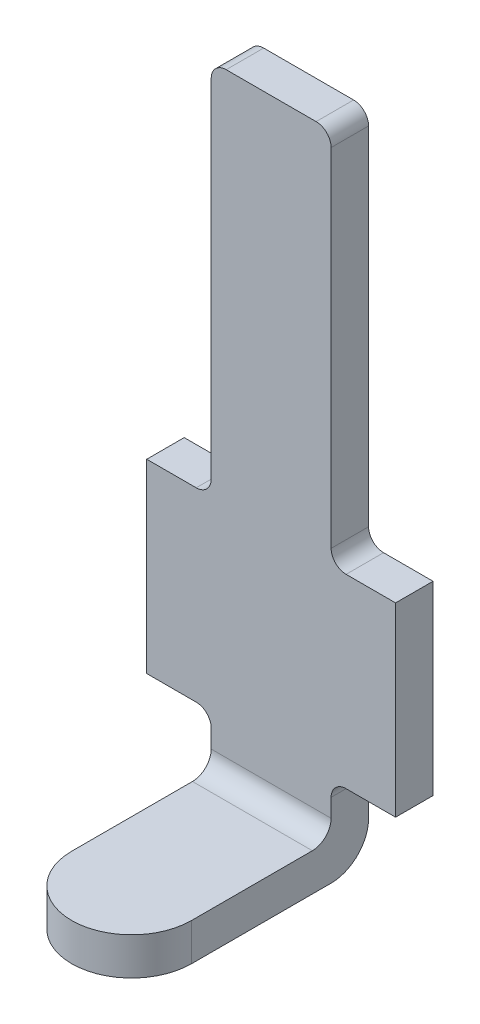
ISO-10303-21;
HEADER;
FILE_DESCRIPTION(('STEP AP214'),'2;1');
FILE_NAME('part.step','',(''),(''),'','','');
FILE_SCHEMA(('AUTOMOTIVE_DESIGN { 1 0 10303 214 1 1 1 1 }'));
ENDSEC;
DATA;
#1=APPLICATION_CONTEXT('core data for automotive mechanical design processes');
#2=APPLICATION_PROTOCOL_DEFINITION('international standard','automotive_design',2000,#1);
#3=PRODUCT_CONTEXT('',#1,'mechanical');
#4=PRODUCT('Part','Part','',(#3));
#5=PRODUCT_RELATED_PRODUCT_CATEGORY('part','',(#4));
#6=PRODUCT_DEFINITION_FORMATION('','',#4);
#7=PRODUCT_DEFINITION_CONTEXT('part definition',#1,'design');
#8=PRODUCT_DEFINITION('design','',#6,#7);
#9=PRODUCT_DEFINITION_SHAPE('','',#8);
#10=(LENGTH_UNIT() NAMED_UNIT(*) SI_UNIT(.MILLI.,.METRE.));
#11=(NAMED_UNIT(*) PLANE_ANGLE_UNIT() SI_UNIT($,.RADIAN.));
#12=(NAMED_UNIT(*) SI_UNIT($,.STERADIAN.) SOLID_ANGLE_UNIT());
#13=UNCERTAINTY_MEASURE_WITH_UNIT(LENGTH_MEASURE(1.E-05),#10,'distance_accuracy_value','');
#14=(GEOMETRIC_REPRESENTATION_CONTEXT(3) GLOBAL_UNCERTAINTY_ASSIGNED_CONTEXT((#13)) GLOBAL_UNIT_ASSIGNED_CONTEXT((#10,
#11,#12)) REPRESENTATION_CONTEXT('',''));
#15=CARTESIAN_POINT('',(0.,0.,0.));
#16=DIRECTION('',(0.,0.,1.));
#17=DIRECTION('',(1.,0.,0.));
#18=AXIS2_PLACEMENT_3D('',#15,#16,#17);
#19=CARTESIAN_POINT('',(8.39,0.0459658151929143,0.749000000000012));
#20=DIRECTION('',(0.,0.,-1.));
#21=DIRECTION('',(-1.,0.,0.));
#22=AXIS2_PLACEMENT_3D('',#19,#20,#21);
#23=CYLINDRICAL_SURFACE('',#22,0.1);
#24=CARTESIAN_POINT('',(8.39,0.0459658151929143,0.498999999999983));
#25=DIRECTION('',(0.,0.,1.));
#26=DIRECTION('',(1.,0.,0.));
#27=AXIS2_PLACEMENT_3D('',#24,#25,#26);
#28=CIRCLE('',#27,0.1);
#29=CARTESIAN_POINT('',(8.49,0.0459658151929143,0.498999999999983));
#30=VERTEX_POINT('',#29);
#31=CARTESIAN_POINT('',(8.39,0.145965815192914,0.499000000000012));
#32=VERTEX_POINT('',#31);
#33=EDGE_CURVE('E411',#30,#32,#28,.T.);
#34=ORIENTED_EDGE('',*,*,#33,.F.);
#35=DIRECTION('',(0.,0.,-1.));
#36=VECTOR('',#35,1.);
#37=CARTESIAN_POINT('',(8.49,0.0459658151929143,0.499000000000012));
#38=LINE('',#37,#36);
#39=CARTESIAN_POINT('',(8.49,0.0459658151929143,0.748999999999983));
#40=VERTEX_POINT('',#39);
#41=EDGE_CURVE('E20',#40,#30,#38,.T.);
#42=ORIENTED_EDGE('',*,*,#41,.F.);
#43=CARTESIAN_POINT('',(8.39,0.0459658151929143,0.748999999999983));
#44=DIRECTION('',(0.,0.,-1.));
#45=DIRECTION('',(-1.,0.,0.));
#46=AXIS2_PLACEMENT_3D('',#43,#44,#45);
#47=CIRCLE('',#46,0.1);
#48=CARTESIAN_POINT('',(8.39,0.145965815192914,0.749000000000012));
#49=VERTEX_POINT('',#48);
#50=EDGE_CURVE('E428',#49,#40,#47,.T.);
#51=ORIENTED_EDGE('',*,*,#50,.F.);
#52=DIRECTION('',(0.,0.,1.));
#53=VECTOR('',#52,1.);
#54=CARTESIAN_POINT('',(8.39,0.145965815192914,0.748999999999983));
#55=LINE('',#54,#53);
#56=EDGE_CURVE('E434',#32,#49,#55,.T.);
#57=ORIENTED_EDGE('',*,*,#56,.F.);
#58=EDGE_LOOP('',(#34,#42,#51,#57));
#59=FACE_BOUND('',#58,.T.);
#60=ADVANCED_FACE('F16',(#59),#23,.F.);
#61=CARTESIAN_POINT('',(9.39,0.0459658151929143,0.748999999999984));
#62=DIRECTION('',(0.,0.,1.));
#63=DIRECTION('',(1.,0.,0.));
#64=AXIS2_PLACEMENT_3D('',#61,#62,#63);
#65=CYLINDRICAL_SURFACE('',#64,0.1);
#66=CARTESIAN_POINT('',(9.39,0.0459658151929143,0.498999999999984));
#67=DIRECTION('',(0.,0.,1.));
#68=DIRECTION('',(1.,0.,0.));
#69=AXIS2_PLACEMENT_3D('',#66,#67,#68);
#70=CIRCLE('',#69,0.1);
#71=CARTESIAN_POINT('',(9.39,0.145965815192914,0.499000000000013));
#72=VERTEX_POINT('',#71);
#73=CARTESIAN_POINT('',(9.29,0.0459658151929143,0.498999999999984));
#74=VERTEX_POINT('',#73);
#75=EDGE_CURVE('E250',#72,#74,#70,.T.);
#76=ORIENTED_EDGE('',*,*,#75,.F.);
#77=DIRECTION('',(0.,0.,-1.));
#78=VECTOR('',#77,1.);
#79=CARTESIAN_POINT('',(9.39,0.145965815192914,0.749000000000013));
#80=LINE('',#79,#78);
#81=CARTESIAN_POINT('',(9.39,0.145965815192914,0.749000000000013));
#82=VERTEX_POINT('',#81);
#83=EDGE_CURVE('E27',#82,#72,#80,.T.);
#84=ORIENTED_EDGE('',*,*,#83,.F.);
#85=CARTESIAN_POINT('',(9.39,0.0459658151929143,0.748999999999984));
#86=DIRECTION('',(0.,0.,-1.));
#87=DIRECTION('',(-1.,0.,0.));
#88=AXIS2_PLACEMENT_3D('',#85,#86,#87);
#89=CIRCLE('',#88,0.1);
#90=CARTESIAN_POINT('',(9.29,0.0459658151929143,0.748999999999984));
#91=VERTEX_POINT('',#90);
#92=EDGE_CURVE('E438',#91,#82,#89,.T.);
#93=ORIENTED_EDGE('',*,*,#92,.F.);
#94=DIRECTION('',(0.,0.,1.));
#95=VECTOR('',#94,1.);
#96=CARTESIAN_POINT('',(9.29,0.0459658151929143,0.748999999999984));
#97=LINE('',#96,#95);
#98=EDGE_CURVE('E266',#74,#91,#97,.T.);
#99=ORIENTED_EDGE('',*,*,#98,.F.);
#100=EDGE_LOOP('',(#76,#84,#93,#99));
#101=FACE_BOUND('',#100,.T.);
#102=ADVANCED_FACE('F534',(#101),#65,.F.);
#103=CARTESIAN_POINT('',(8.39,1.48437551370885,0.748999999999983));
#104=DIRECTION('',(0.,0.,1.));
#105=DIRECTION('',(1.,0.,0.));
#106=AXIS2_PLACEMENT_3D('',#103,#104,#105);
#107=CYLINDRICAL_SURFACE('',#106,0.1);
#108=CARTESIAN_POINT('',(8.39,1.48437551370885,0.498999999999983));
#109=DIRECTION('',(0.,0.,1.));
#110=DIRECTION('',(1.,0.,0.));
#111=AXIS2_PLACEMENT_3D('',#108,#109,#110);
#112=CIRCLE('',#111,0.1);
#113=CARTESIAN_POINT('',(8.39,1.38437551370885,0.499000000000012));
#114=VERTEX_POINT('',#113);
#115=CARTESIAN_POINT('',(8.49,1.48437551370885,0.498999999999983));
#116=VERTEX_POINT('',#115);
#117=EDGE_CURVE('E321',#114,#116,#112,.T.);
#118=ORIENTED_EDGE('',*,*,#117,.F.);
#119=DIRECTION('',(0.,0.,-1.));
#120=VECTOR('',#119,1.);
#121=CARTESIAN_POINT('',(8.39,1.38437551370885,0.749000000000012));
#122=LINE('',#121,#120);
#123=CARTESIAN_POINT('',(8.39,1.38437551370885,0.749000000000012));
#124=VERTEX_POINT('',#123);
#125=EDGE_CURVE('E42',#124,#114,#122,.T.);
#126=ORIENTED_EDGE('',*,*,#125,.F.);
#127=CARTESIAN_POINT('',(8.39,1.48437551370885,0.748999999999983));
#128=DIRECTION('',(0.,0.,-1.));
#129=DIRECTION('',(-1.,0.,0.));
#130=AXIS2_PLACEMENT_3D('',#127,#128,#129);
#131=CIRCLE('',#130,0.1);
#132=CARTESIAN_POINT('',(8.49,1.48437551370885,0.748999999999983));
#133=VERTEX_POINT('',#132);
#134=EDGE_CURVE('E265',#133,#124,#131,.T.);
#135=ORIENTED_EDGE('',*,*,#134,.F.);
#136=DIRECTION('',(0.,0.,1.));
#137=VECTOR('',#136,1.);
#138=CARTESIAN_POINT('',(8.49,1.48437551370885,0.748999999999983));
#139=LINE('',#138,#137);
#140=EDGE_CURVE('E240',#116,#133,#139,.T.);
#141=ORIENTED_EDGE('',*,*,#140,.F.);
#142=EDGE_LOOP('',(#118,#126,#135,#141));
#143=FACE_BOUND('',#142,.T.);
#144=ADVANCED_FACE('F540',(#143),#107,.F.);
#145=CARTESIAN_POINT('',(9.39,1.48437551370885,0.749000000000014));
#146=DIRECTION('',(0.,0.,-1.));
#147=DIRECTION('',(-1.,0.,0.));
#148=AXIS2_PLACEMENT_3D('',#145,#146,#147);
#149=CYLINDRICAL_SURFACE('',#148,0.1);
#150=CARTESIAN_POINT('',(9.39,1.48437551370885,0.498999999999985));
#151=DIRECTION('',(0.,0.,1.));
#152=DIRECTION('',(1.,0.,0.));
#153=AXIS2_PLACEMENT_3D('',#150,#151,#152);
#154=CIRCLE('',#153,0.1);
#155=CARTESIAN_POINT('',(9.29,1.48437551370885,0.498999999999984));
#156=VERTEX_POINT('',#155);
#157=CARTESIAN_POINT('',(9.39,1.38437551370885,0.499000000000013));
#158=VERTEX_POINT('',#157);
#159=EDGE_CURVE('E216',#156,#158,#154,.T.);
#160=ORIENTED_EDGE('',*,*,#159,.F.);
#161=DIRECTION('',(0.,0.,-1.));
#162=VECTOR('',#161,1.);
#163=CARTESIAN_POINT('',(9.29,1.48437551370885,0.498999999999984));
#164=LINE('',#163,#162);
#165=CARTESIAN_POINT('',(9.29,1.48437551370885,0.748999999999984));
#166=VERTEX_POINT('',#165);
#167=EDGE_CURVE('E340',#166,#156,#164,.T.);
#168=ORIENTED_EDGE('',*,*,#167,.F.);
#169=CARTESIAN_POINT('',(9.39,1.48437551370885,0.748999999999984));
#170=DIRECTION('',(0.,0.,-1.));
#171=DIRECTION('',(-1.,0.,0.));
#172=AXIS2_PLACEMENT_3D('',#169,#170,#171);
#173=CIRCLE('',#172,0.1);
#174=CARTESIAN_POINT('',(9.39,1.38437551370885,0.749000000000014));
#175=VERTEX_POINT('',#174);
#176=EDGE_CURVE('E168',#175,#166,#173,.T.);
#177=ORIENTED_EDGE('',*,*,#176,.F.);
#178=DIRECTION('',(0.,0.,1.));
#179=VECTOR('',#178,1.);
#180=CARTESIAN_POINT('',(9.39,1.38437551370885,0.748999999999984));
#181=LINE('',#180,#179);
#182=EDGE_CURVE('E394',#158,#175,#181,.T.);
#183=ORIENTED_EDGE('',*,*,#182,.F.);
#184=EDGE_LOOP('',(#160,#168,#177,#183));
#185=FACE_BOUND('',#184,.T.);
#186=ADVANCED_FACE('F18',(#185),#149,.F.);
#187=CARTESIAN_POINT('',(8.59,3.8,0.748999999999983));
#188=DIRECTION('',(0.,0.,-1.));
#189=DIRECTION('',(-1.,0.,0.));
#190=AXIS2_PLACEMENT_3D('',#187,#188,#189);
#191=CYLINDRICAL_SURFACE('',#190,0.1);
#192=CARTESIAN_POINT('',(8.59,3.8,0.498999999999984));
#193=DIRECTION('',(0.,0.,-1.));
#194=DIRECTION('',(1.,0.,0.));
#195=AXIS2_PLACEMENT_3D('',#192,#193,#194);
#196=CIRCLE('',#195,0.1);
#197=CARTESIAN_POINT('',(8.49,3.8,0.498999999999984));
#198=VERTEX_POINT('',#197);
#199=CARTESIAN_POINT('',(8.59,3.9,0.498999999999984));
#200=VERTEX_POINT('',#199);
#201=EDGE_CURVE('E223',#198,#200,#196,.T.);
#202=ORIENTED_EDGE('',*,*,#201,.F.);
#203=DIRECTION('',(0.,0.,-1.));
#204=VECTOR('',#203,1.);
#205=CARTESIAN_POINT('',(8.49,3.8,0.498999999999984));
#206=LINE('',#205,#204);
#207=CARTESIAN_POINT('',(8.49,3.8,0.748999999999983));
#208=VERTEX_POINT('',#207);
#209=EDGE_CURVE('E339',#208,#198,#206,.T.);
#210=ORIENTED_EDGE('',*,*,#209,.F.);
#211=CARTESIAN_POINT('',(8.59,3.8,0.748999999999983));
#212=DIRECTION('',(0.,0.,1.));
#213=DIRECTION('',(-1.,0.,0.));
#214=AXIS2_PLACEMENT_3D('',#211,#212,#213);
#215=CIRCLE('',#214,0.1);
#216=CARTESIAN_POINT('',(8.59,3.9,0.748999999999983));
#217=VERTEX_POINT('',#216);
#218=EDGE_CURVE('E262',#217,#208,#215,.T.);
#219=ORIENTED_EDGE('',*,*,#218,.F.);
#220=DIRECTION('',(0.,0.,1.));
#221=VECTOR('',#220,1.);
#222=CARTESIAN_POINT('',(8.59,3.9,0.748999999999983));
#223=LINE('',#222,#221);
#224=EDGE_CURVE('E228',#200,#217,#223,.T.);
#225=ORIENTED_EDGE('',*,*,#224,.F.);
#226=EDGE_LOOP('',(#202,#210,#219,#225));
#227=FACE_BOUND('',#226,.T.);
#228=ADVANCED_FACE('F502',(#227),#191,.T.);
#229=CARTESIAN_POINT('',(9.19,3.8,0.748999999999984));
#230=DIRECTION('',(0.,0.,1.));
#231=DIRECTION('',(1.,0.,0.));
#232=AXIS2_PLACEMENT_3D('',#229,#230,#231);
#233=CYLINDRICAL_SURFACE('',#232,0.1);
#234=CARTESIAN_POINT('',(9.19,3.8,0.498999999999985));
#235=DIRECTION('',(0.,0.,-1.));
#236=DIRECTION('',(1.,0.,0.));
#237=AXIS2_PLACEMENT_3D('',#234,#235,#236);
#238=CIRCLE('',#237,0.1);
#239=CARTESIAN_POINT('',(9.19,3.9,0.498999999999985));
#240=VERTEX_POINT('',#239);
#241=CARTESIAN_POINT('',(9.29,3.8,0.498999999999985));
#242=VERTEX_POINT('',#241);
#243=EDGE_CURVE('E204',#240,#242,#238,.T.);
#244=ORIENTED_EDGE('',*,*,#243,.F.);
#245=DIRECTION('',(0.,0.,-1.));
#246=VECTOR('',#245,1.);
#247=CARTESIAN_POINT('',(9.19,3.9,0.748999999999984));
#248=LINE('',#247,#246);
#249=CARTESIAN_POINT('',(9.19,3.9,0.748999999999984));
#250=VERTEX_POINT('',#249);
#251=EDGE_CURVE('E208',#250,#240,#248,.T.);
#252=ORIENTED_EDGE('',*,*,#251,.F.);
#253=CARTESIAN_POINT('',(9.19,3.8,0.748999999999984));
#254=DIRECTION('',(0.,0.,1.));
#255=DIRECTION('',(-1.,0.,0.));
#256=AXIS2_PLACEMENT_3D('',#253,#254,#255);
#257=CIRCLE('',#256,0.1);
#258=CARTESIAN_POINT('',(9.29,3.8,0.748999999999984));
#259=VERTEX_POINT('',#258);
#260=EDGE_CURVE('E155',#259,#250,#257,.T.);
#261=ORIENTED_EDGE('',*,*,#260,.F.);
#262=DIRECTION('',(0.,0.,1.));
#263=VECTOR('',#262,1.);
#264=CARTESIAN_POINT('',(9.29,3.8,0.748999999999984));
#265=LINE('',#264,#263);
#266=EDGE_CURVE('E211',#242,#259,#265,.T.);
#267=ORIENTED_EDGE('',*,*,#266,.F.);
#268=EDGE_LOOP('',(#244,#252,#261,#267));
#269=FACE_BOUND('',#268,.T.);
#270=ADVANCED_FACE('F206',(#269),#233,.T.);
#271=CARTESIAN_POINT('',(9.72,0.,1.00308650274883E-13));
#272=DIRECTION('',(-1.,0.,0.));
#273=DIRECTION('',(0.,0.,1.));
#274=AXIS2_PLACEMENT_3D('',#271,#272,#273);
#275=PLANE('',#274);
#276=DIRECTION('',(0.,0.,-1.));
#277=VECTOR('',#276,1.);
#278=CARTESIAN_POINT('',(9.72,1.38437551370885,0.749000000000014));
#279=LINE('',#278,#277);
#280=CARTESIAN_POINT('',(9.72,1.38437551370885,0.749000000000014));
#281=VERTEX_POINT('',#280);
#282=CARTESIAN_POINT('',(9.72,1.38437551370885,0.499000000000014));
#283=VERTEX_POINT('',#282);
#284=EDGE_CURVE('E484',#281,#283,#279,.T.);
#285=ORIENTED_EDGE('',*,*,#284,.F.);
#286=DIRECTION('',(0.,-1.,0.));
#287=VECTOR('',#286,1.);
#288=CARTESIAN_POINT('',(9.72,1.38437551370885,0.749000000000014));
#289=LINE('',#288,#287);
#290=CARTESIAN_POINT('',(9.72,0.145965815192914,0.749000000000014));
#291=VERTEX_POINT('',#290);
#292=EDGE_CURVE('E256',#281,#291,#289,.T.);
#293=ORIENTED_EDGE('',*,*,#292,.T.);
#294=DIRECTION('',(0.,0.,-1.));
#295=VECTOR('',#294,1.);
#296=CARTESIAN_POINT('',(9.72,0.145965815192914,0.749000000000014));
#297=LINE('',#296,#295);
#298=CARTESIAN_POINT('',(9.72,0.145965815192914,0.499000000000014));
#299=VERTEX_POINT('',#298);
#300=EDGE_CURVE('E11',#291,#299,#297,.T.);
#301=ORIENTED_EDGE('',*,*,#300,.T.);
#302=DIRECTION('',(0.,-1.,0.));
#303=VECTOR('',#302,1.);
#304=CARTESIAN_POINT('',(9.72,1.38437551370885,0.499000000000014));
#305=LINE('',#304,#303);
#306=EDGE_CURVE('E313',#283,#299,#305,.T.);
#307=ORIENTED_EDGE('',*,*,#306,.F.);
#308=EDGE_LOOP('',(#285,#293,#301,#307));
#309=FACE_BOUND('',#308,.T.);
#310=ADVANCED_FACE('F545',(#309),#275,.F.);
#311=CARTESIAN_POINT('',(8.06,0.145965815192914,0.749000000000011));
#312=DIRECTION('',(0.,-1.,0.));
#313=DIRECTION('',(0.,0.,-1.));
#314=AXIS2_PLACEMENT_3D('',#311,#312,#313);
#315=PLANE('',#314);
#316=DIRECTION('',(1.,0.,0.));
#317=VECTOR('',#316,1.);
#318=CARTESIAN_POINT('',(8.06,0.145965815192914,0.749000000000011));
#319=LINE('',#318,#317);
#320=EDGE_CURVE('E261',#82,#291,#319,.T.);
#321=ORIENTED_EDGE('',*,*,#320,.F.);
#322=ORIENTED_EDGE('',*,*,#83,.T.);
#323=DIRECTION('',(1.,0.,0.));
#324=VECTOR('',#323,1.);
#325=CARTESIAN_POINT('',(8.06,0.145965815192914,0.499000000000011));
#326=LINE('',#325,#324);
#327=EDGE_CURVE('E255',#72,#299,#326,.T.);
#328=ORIENTED_EDGE('',*,*,#327,.T.);
#329=ORIENTED_EDGE('',*,*,#300,.F.);
#330=EDGE_LOOP('',(#321,#322,#328,#329));
#331=FACE_BOUND('',#330,.T.);
#332=ADVANCED_FACE('F548',(#331),#315,.T.);
#333=CARTESIAN_POINT('',(8.06,1.38437551370885,0.749000000000012));
#334=DIRECTION('',(0.,-1.,0.));
#335=DIRECTION('',(0.,0.,-1.));
#336=AXIS2_PLACEMENT_3D('',#333,#334,#335);
#337=PLANE('',#336);
#338=DIRECTION('',(1.,0.,0.));
#339=VECTOR('',#338,1.);
#340=CARTESIAN_POINT('',(8.06,1.38437551370885,0.499000000000011));
#341=LINE('',#340,#339);
#342=EDGE_CURVE('E317',#158,#283,#341,.T.);
#343=ORIENTED_EDGE('',*,*,#342,.F.);
#344=ORIENTED_EDGE('',*,*,#182,.T.);
#345=DIRECTION('',(1.,0.,0.));
#346=VECTOR('',#345,1.);
#347=CARTESIAN_POINT('',(8.06,1.38437551370885,0.749000000000012));
#348=LINE('',#347,#346);
#349=EDGE_CURVE('E260',#175,#281,#348,.T.);
#350=ORIENTED_EDGE('',*,*,#349,.T.);
#351=ORIENTED_EDGE('',*,*,#284,.T.);
#352=EDGE_LOOP('',(#343,#344,#350,#351));
#353=FACE_BOUND('',#352,.T.);
#354=ADVANCED_FACE('F557',(#353),#337,.F.);
#355=CARTESIAN_POINT('',(8.06,1.38437551370885,0.749000000000012));
#356=DIRECTION('',(0.,-1.,0.));
#357=DIRECTION('',(0.,0.,-1.));
#358=AXIS2_PLACEMENT_3D('',#355,#356,#357);
#359=PLANE('',#358);
#360=DIRECTION('',(1.,0.,0.));
#361=VECTOR('',#360,1.);
#362=CARTESIAN_POINT('',(8.06,1.38437551370885,0.749000000000012));
#363=LINE('',#362,#361);
#364=CARTESIAN_POINT('',(8.06,1.38437551370885,0.749000000000012));
#365=VERTEX_POINT('',#364);
#366=EDGE_CURVE('E374',#365,#124,#363,.T.);
#367=ORIENTED_EDGE('',*,*,#366,.T.);
#368=ORIENTED_EDGE('',*,*,#125,.T.);
#369=DIRECTION('',(1.,0.,0.));
#370=VECTOR('',#369,1.);
#371=CARTESIAN_POINT('',(8.06,1.38437551370885,0.499000000000011));
#372=LINE('',#371,#370);
#373=CARTESIAN_POINT('',(8.06,1.38437551370885,0.499000000000011));
#374=VERTEX_POINT('',#373);
#375=EDGE_CURVE('E324',#374,#114,#372,.T.);
#376=ORIENTED_EDGE('',*,*,#375,.F.);
#377=DIRECTION('',(0.,0.,-1.));
#378=VECTOR('',#377,1.);
#379=CARTESIAN_POINT('',(8.06,1.38437551370885,0.749000000000012));
#380=LINE('',#379,#378);
#381=EDGE_CURVE('E332',#365,#374,#380,.T.);
#382=ORIENTED_EDGE('',*,*,#381,.F.);
#383=EDGE_LOOP('',(#367,#368,#376,#382));
#384=FACE_BOUND('',#383,.T.);
#385=ADVANCED_FACE('F554',(#384),#359,.F.);
#386=CARTESIAN_POINT('',(8.06,0.145965815192914,0.749000000000011));
#387=DIRECTION('',(0.,-1.,0.));
#388=DIRECTION('',(0.,0.,-1.));
#389=AXIS2_PLACEMENT_3D('',#386,#387,#388);
#390=PLANE('',#389);
#391=DIRECTION('',(1.,0.,0.));
#392=VECTOR('',#391,1.);
#393=CARTESIAN_POINT('',(8.06,0.145965815192914,0.499000000000011));
#394=LINE('',#393,#392);
#395=CARTESIAN_POINT('',(8.06,0.145965815192914,0.499000000000011));
#396=VERTEX_POINT('',#395);
#397=EDGE_CURVE('E415',#396,#32,#394,.T.);
#398=ORIENTED_EDGE('',*,*,#397,.T.);
#399=ORIENTED_EDGE('',*,*,#56,.T.);
#400=DIRECTION('',(1.,0.,0.));
#401=VECTOR('',#400,1.);
#402=CARTESIAN_POINT('',(8.06,0.145965815192914,0.749000000000011));
#403=LINE('',#402,#401);
#404=CARTESIAN_POINT('',(8.06,0.145965815192914,0.749000000000011));
#405=VERTEX_POINT('',#404);
#406=EDGE_CURVE('E384',#405,#49,#403,.T.);
#407=ORIENTED_EDGE('',*,*,#406,.F.);
#408=DIRECTION('',(0.,0.,-1.));
#409=VECTOR('',#408,1.);
#410=CARTESIAN_POINT('',(8.06,0.145965815192914,0.749000000000011));
#411=LINE('',#410,#409);
#412=EDGE_CURVE('E418',#405,#396,#411,.T.);
#413=ORIENTED_EDGE('',*,*,#412,.T.);
#414=EDGE_LOOP('',(#398,#399,#407,#413));
#415=FACE_BOUND('',#414,.T.);
#416=ADVANCED_FACE('F465',(#415),#390,.T.);
#417=CARTESIAN_POINT('',(8.06,0.,0.));
#418=DIRECTION('',(-1.,0.,0.));
#419=DIRECTION('',(0.,0.,1.));
#420=AXIS2_PLACEMENT_3D('',#417,#418,#419);
#421=PLANE('',#420);
#422=ORIENTED_EDGE('',*,*,#381,.T.);
#423=DIRECTION('',(0.,-1.,0.));
#424=VECTOR('',#423,1.);
#425=CARTESIAN_POINT('',(8.06,1.38437551370885,0.499000000000011));
#426=LINE('',#425,#424);
#427=EDGE_CURVE('E400',#374,#396,#426,.T.);
#428=ORIENTED_EDGE('',*,*,#427,.T.);
#429=ORIENTED_EDGE('',*,*,#412,.F.);
#430=DIRECTION('',(0.,-1.,0.));
#431=VECTOR('',#430,1.);
#432=CARTESIAN_POINT('',(8.06,1.38437551370885,0.749000000000012));
#433=LINE('',#432,#431);
#434=EDGE_CURVE('E376',#365,#405,#433,.T.);
#435=ORIENTED_EDGE('',*,*,#434,.F.);
#436=EDGE_LOOP('',(#422,#428,#429,#435));
#437=FACE_BOUND('',#436,.T.);
#438=ADVANCED_FACE('F471',(#437),#421,.T.);
#439=CARTESIAN_POINT('',(8.89,-0.2,1.68));
#440=DIRECTION('',(0.,-1.,0.));
#441=DIRECTION('',(0.,0.,-1.));
#442=AXIS2_PLACEMENT_3D('',#439,#440,#441);
#443=CYLINDRICAL_SURFACE('',#442,0.4);
#444=DIRECTION('',(0.,-1.,0.));
#445=VECTOR('',#444,1.);
#446=CARTESIAN_POINT('',(9.29,-0.2,1.68));
#447=LINE('',#446,#445);
#448=CARTESIAN_POINT('',(9.29,-0.2,1.68));
#449=VERTEX_POINT('',#448);
#450=CARTESIAN_POINT('',(9.29,-0.45,1.68));
#451=VERTEX_POINT('',#450);
#452=EDGE_CURVE('E270',#449,#451,#447,.T.);
#453=ORIENTED_EDGE('',*,*,#452,.F.);
#454=CARTESIAN_POINT('',(8.89,-0.2,1.68));
#455=DIRECTION('',(0.,1.,0.));
#456=DIRECTION('',(0.,0.,-1.));
#457=AXIS2_PLACEMENT_3D('',#454,#455,#456);
#458=CIRCLE('',#457,0.4);
#459=CARTESIAN_POINT('',(8.49,-0.2,1.68));
#460=VERTEX_POINT('',#459);
#461=EDGE_CURVE('E299',#460,#449,#458,.T.);
#462=ORIENTED_EDGE('',*,*,#461,.F.);
#463=DIRECTION('',(0.,1.,0.));
#464=VECTOR('',#463,1.);
#465=CARTESIAN_POINT('',(8.49,-0.2,1.68));
#466=LINE('',#465,#464);
#467=CARTESIAN_POINT('',(8.49,-0.45,1.68));
#468=VERTEX_POINT('',#467);
#469=EDGE_CURVE('E329',#468,#460,#466,.T.);
#470=ORIENTED_EDGE('',*,*,#469,.F.);
#471=CARTESIAN_POINT('',(8.89,-0.45,1.68));
#472=DIRECTION('',(0.,-1.,0.));
#473=DIRECTION('',(0.,0.,1.));
#474=AXIS2_PLACEMENT_3D('',#471,#472,#473);
#475=CIRCLE('',#474,0.4);
#476=EDGE_CURVE('E312',#451,#468,#475,.T.);
#477=ORIENTED_EDGE('',*,*,#476,.F.);
#478=EDGE_LOOP('',(#453,#462,#470,#477));
#479=FACE_BOUND('',#478,.T.);
#480=ADVANCED_FACE('F810',(#479),#443,.T.);
#481=CARTESIAN_POINT('',(8.49,-0.2,0.748999999999983));
#482=DIRECTION('',(-1.,0.,0.));
#483=DIRECTION('',(0.,0.,1.));
#484=AXIS2_PLACEMENT_3D('',#481,#482,#483);
#485=PLANE('',#484);
#486=DIRECTION('',(0.,-1.,0.));
#487=VECTOR('',#486,1.);
#488=CARTESIAN_POINT('',(8.49,3.9,0.748999999999983));
#489=LINE('',#488,#487);
#490=CARTESIAN_POINT('',(8.49,-0.0749999999999988,0.748999999999983));
#491=VERTEX_POINT('',#490);
#492=EDGE_CURVE('E423',#40,#491,#489,.T.);
#493=ORIENTED_EDGE('',*,*,#492,.F.);
#494=ORIENTED_EDGE('',*,*,#41,.T.);
#495=DIRECTION('',(0.,1.,0.));
#496=VECTOR('',#495,1.);
#497=CARTESIAN_POINT('',(8.49,3.9,0.498999999999984));
#498=LINE('',#497,#496);
#499=CARTESIAN_POINT('',(8.49,-0.2,0.498999999999983));
#500=VERTEX_POINT('',#499);
#501=EDGE_CURVE('E396',#500,#30,#498,.T.);
#502=ORIENTED_EDGE('',*,*,#501,.F.);
#503=CARTESIAN_POINT('',(8.49,-0.2,0.748999999999983));
#504=DIRECTION('',(1.,0.,0.));
#505=DIRECTION('',(0.,0.,1.));
#506=AXIS2_PLACEMENT_3D('',#503,#504,#505);
#507=CIRCLE('',#506,0.25);
#508=CARTESIAN_POINT('',(8.49,-0.45,0.748999999999983));
#509=VERTEX_POINT('',#508);
#510=EDGE_CURVE('E245',#509,#500,#507,.T.);
#511=ORIENTED_EDGE('',*,*,#510,.F.);
#512=DIRECTION('',(0.,0.,-1.));
#513=VECTOR('',#512,1.);
#514=CARTESIAN_POINT('',(8.49,-0.45,0.748999999999983));
#515=LINE('',#514,#513);
#516=EDGE_CURVE('E308',#468,#509,#515,.T.);
#517=ORIENTED_EDGE('',*,*,#516,.F.);
#518=ORIENTED_EDGE('',*,*,#469,.T.);
#519=DIRECTION('',(0.,0.,1.));
#520=VECTOR('',#519,1.);
#521=CARTESIAN_POINT('',(8.49,-0.2,0.873999999999983));
#522=LINE('',#521,#520);
#523=CARTESIAN_POINT('',(8.49,-0.2,0.873999999999983));
#524=VERTEX_POINT('',#523);
#525=EDGE_CURVE('E287',#524,#460,#522,.T.);
#526=ORIENTED_EDGE('',*,*,#525,.F.);
#527=CARTESIAN_POINT('',(8.49,-0.0749999999999988,0.873999999999983));
#528=DIRECTION('',(-1.,0.,0.));
#529=DIRECTION('',(0.,0.,1.));
#530=AXIS2_PLACEMENT_3D('',#527,#528,#529);
#531=CIRCLE('',#530,0.125);
#532=EDGE_CURVE('E272',#491,#524,#531,.T.);
#533=ORIENTED_EDGE('',*,*,#532,.F.);
#534=EDGE_LOOP('',(#493,#494,#502,#511,#517,#518,#526,#533));
#535=FACE_BOUND('',#534,.T.);
#536=ADVANCED_FACE('F795',(#535),#485,.T.);
#537=CARTESIAN_POINT('',(9.29,-0.2,0.748999999999984));
#538=DIRECTION('',(-1.,0.,0.));
#539=DIRECTION('',(0.,0.,1.));
#540=AXIS2_PLACEMENT_3D('',#537,#538,#539);
#541=PLANE('',#540);
#542=DIRECTION('',(0.,1.,0.));
#543=VECTOR('',#542,1.);
#544=CARTESIAN_POINT('',(9.29,3.9,0.498999999999985));
#545=LINE('',#544,#543);
#546=CARTESIAN_POINT('',(9.29,-0.2,0.498999999999984));
#547=VERTEX_POINT('',#546);
#548=EDGE_CURVE('E254',#547,#74,#545,.T.);
#549=ORIENTED_EDGE('',*,*,#548,.T.);
#550=ORIENTED_EDGE('',*,*,#98,.T.);
#551=DIRECTION('',(0.,-1.,0.));
#552=VECTOR('',#551,1.);
#553=CARTESIAN_POINT('',(9.29,3.9,0.748999999999984));
#554=LINE('',#553,#552);
#555=CARTESIAN_POINT('',(9.29,-0.0749999999999988,0.748999999999984));
#556=VERTEX_POINT('',#555);
#557=EDGE_CURVE('E445',#91,#556,#554,.T.);
#558=ORIENTED_EDGE('',*,*,#557,.T.);
#559=CARTESIAN_POINT('',(9.29,-0.0749999999999988,0.873999999999984));
#560=DIRECTION('',(-1.,0.,0.));
#561=DIRECTION('',(0.,0.,1.));
#562=AXIS2_PLACEMENT_3D('',#559,#560,#561);
#563=CIRCLE('',#562,0.125);
#564=CARTESIAN_POINT('',(9.29,-0.2,0.873999999999984));
#565=VERTEX_POINT('',#564);
#566=EDGE_CURVE('E276',#556,#565,#563,.T.);
#567=ORIENTED_EDGE('',*,*,#566,.T.);
#568=DIRECTION('',(0.,0.,1.));
#569=VECTOR('',#568,1.);
#570=CARTESIAN_POINT('',(9.29,-0.2,0.873999999999984));
#571=LINE('',#570,#569);
#572=EDGE_CURVE('E303',#565,#449,#571,.T.);
#573=ORIENTED_EDGE('',*,*,#572,.T.);
#574=ORIENTED_EDGE('',*,*,#452,.T.);
#575=DIRECTION('',(0.,0.,-1.));
#576=VECTOR('',#575,1.);
#577=CARTESIAN_POINT('',(9.29,-0.45,0.748999999999984));
#578=LINE('',#577,#576);
#579=CARTESIAN_POINT('',(9.29,-0.45,0.748999999999984));
#580=VERTEX_POINT('',#579);
#581=EDGE_CURVE('E248',#451,#580,#578,.T.);
#582=ORIENTED_EDGE('',*,*,#581,.T.);
#583=CARTESIAN_POINT('',(9.29,-0.2,0.748999999999984));
#584=DIRECTION('',(1.,0.,0.));
#585=DIRECTION('',(0.,0.,1.));
#586=AXIS2_PLACEMENT_3D('',#583,#584,#585);
#587=CIRCLE('',#586,0.25);
#588=EDGE_CURVE('E217',#580,#547,#587,.T.);
#589=ORIENTED_EDGE('',*,*,#588,.T.);
#590=EDGE_LOOP('',(#549,#550,#558,#567,#573,#574,#582,#589));
#591=FACE_BOUND('',#590,.T.);
#592=ADVANCED_FACE('F351',(#591),#541,.F.);
#593=CARTESIAN_POINT('',(9.29,3.9,0.498999999999985));
#594=DIRECTION('',(0.,0.,1.));
#595=DIRECTION('',(1.,0.,0.));
#596=AXIS2_PLACEMENT_3D('',#593,#594,#595);
#597=PLANE('',#596);
#598=DIRECTION('',(-1.,0.,0.));
#599=VECTOR('',#598,1.);
#600=CARTESIAN_POINT('',(9.29,3.9,0.498999999999985));
#601=LINE('',#600,#599);
#602=EDGE_CURVE('E220',#240,#200,#601,.T.);
#603=ORIENTED_EDGE('',*,*,#602,.F.);
#604=ORIENTED_EDGE('',*,*,#243,.T.);
#605=DIRECTION('',(0.,1.,0.));
#606=VECTOR('',#605,1.);
#607=CARTESIAN_POINT('',(9.29,3.9,0.498999999999985));
#608=LINE('',#607,#606);
#609=EDGE_CURVE('E373',#156,#242,#608,.T.);
#610=ORIENTED_EDGE('',*,*,#609,.F.);
#611=ORIENTED_EDGE('',*,*,#159,.T.);
#612=ORIENTED_EDGE('',*,*,#342,.T.);
#613=ORIENTED_EDGE('',*,*,#306,.T.);
#614=ORIENTED_EDGE('',*,*,#327,.F.);
#615=ORIENTED_EDGE('',*,*,#75,.T.);
#616=ORIENTED_EDGE('',*,*,#548,.F.);
#617=DIRECTION('',(-1.,0.,0.));
#618=VECTOR('',#617,1.);
#619=CARTESIAN_POINT('',(9.29,-0.2,0.498999999999984));
#620=LINE('',#619,#618);
#621=EDGE_CURVE('E247',#547,#500,#620,.T.);
#622=ORIENTED_EDGE('',*,*,#621,.T.);
#623=ORIENTED_EDGE('',*,*,#501,.T.);
#624=ORIENTED_EDGE('',*,*,#33,.T.);
#625=ORIENTED_EDGE('',*,*,#397,.F.);
#626=ORIENTED_EDGE('',*,*,#427,.F.);
#627=ORIENTED_EDGE('',*,*,#375,.T.);
#628=ORIENTED_EDGE('',*,*,#117,.T.);
#629=DIRECTION('',(0.,1.,0.));
#630=VECTOR('',#629,1.);
#631=CARTESIAN_POINT('',(8.49,3.9,0.498999999999984));
#632=LINE('',#631,#630);
#633=EDGE_CURVE('E328',#116,#198,#632,.T.);
#634=ORIENTED_EDGE('',*,*,#633,.T.);
#635=ORIENTED_EDGE('',*,*,#201,.T.);
#636=EDGE_LOOP('',(#603,#604,#610,#611,#612,#613,#614,#615,#616,#622,#623,#624,#625,#626,#627,
#628,#634,#635));
#637=FACE_BOUND('',#636,.T.);
#638=ADVANCED_FACE('F221',(#637),#597,.F.);
#639=CARTESIAN_POINT('',(9.29,-0.2,0.748999999999984));
#640=DIRECTION('',(-1.,0.,0.));
#641=DIRECTION('',(0.,0.,1.));
#642=AXIS2_PLACEMENT_3D('',#639,#640,#641);
#643=CYLINDRICAL_SURFACE('',#642,0.25);
#644=ORIENTED_EDGE('',*,*,#510,.T.);
#645=ORIENTED_EDGE('',*,*,#621,.F.);
#646=ORIENTED_EDGE('',*,*,#588,.F.);
#647=DIRECTION('',(-1.,0.,0.));
#648=VECTOR('',#647,1.);
#649=CARTESIAN_POINT('',(9.29,-0.45,0.748999999999984));
#650=LINE('',#649,#648);
#651=EDGE_CURVE('E304',#580,#509,#650,.T.);
#652=ORIENTED_EDGE('',*,*,#651,.T.);
#653=EDGE_LOOP('',(#644,#645,#646,#652));
#654=FACE_BOUND('',#653,.T.);
#655=ADVANCED_FACE('F360',(#654),#643,.T.);
#656=CARTESIAN_POINT('',(9.29,-0.45,0.748999999999984));
#657=DIRECTION('',(0.,1.,0.));
#658=DIRECTION('',(0.,0.,-1.));
#659=AXIS2_PLACEMENT_3D('',#656,#657,#658);
#660=PLANE('',#659);
#661=ORIENTED_EDGE('',*,*,#476,.T.);
#662=ORIENTED_EDGE('',*,*,#516,.T.);
#663=ORIENTED_EDGE('',*,*,#651,.F.);
#664=ORIENTED_EDGE('',*,*,#581,.F.);
#665=EDGE_LOOP('',(#661,#662,#663,#664));
#666=FACE_BOUND('',#665,.T.);
#667=ADVANCED_FACE('F357',(#666),#660,.F.);
#668=CARTESIAN_POINT('',(9.29,-0.2,0.873999999999984));
#669=DIRECTION('',(0.,-1.,0.));
#670=DIRECTION('',(0.,0.,-1.));
#671=AXIS2_PLACEMENT_3D('',#668,#669,#670);
#672=PLANE('',#671);
#673=ORIENTED_EDGE('',*,*,#525,.T.);
#674=ORIENTED_EDGE('',*,*,#461,.T.);
#675=ORIENTED_EDGE('',*,*,#572,.F.);
#676=DIRECTION('',(-1.,0.,0.));
#677=VECTOR('',#676,1.);
#678=CARTESIAN_POINT('',(9.29,-0.2,0.873999999999984));
#679=LINE('',#678,#677);
#680=EDGE_CURVE('E273',#565,#524,#679,.T.);
#681=ORIENTED_EDGE('',*,*,#680,.T.);
#682=EDGE_LOOP('',(#673,#674,#675,#681));
#683=FACE_BOUND('',#682,.T.);
#684=ADVANCED_FACE('F530',(#683),#672,.F.);
#685=CARTESIAN_POINT('',(9.29,-0.0749999999999988,0.873999999999984));
#686=DIRECTION('',(-1.,0.,0.));
#687=DIRECTION('',(0.,0.,1.));
#688=AXIS2_PLACEMENT_3D('',#685,#686,#687);
#689=CYLINDRICAL_SURFACE('',#688,0.125);
#690=ORIENTED_EDGE('',*,*,#532,.T.);
#691=ORIENTED_EDGE('',*,*,#680,.F.);
#692=ORIENTED_EDGE('',*,*,#566,.F.);
#693=DIRECTION('',(-1.,0.,0.));
#694=VECTOR('',#693,1.);
#695=CARTESIAN_POINT('',(9.29,-0.0749999999999988,0.748999999999984));
#696=LINE('',#695,#694);
#697=EDGE_CURVE('E427',#556,#491,#696,.T.);
#698=ORIENTED_EDGE('',*,*,#697,.T.);
#699=EDGE_LOOP('',(#690,#691,#692,#698));
#700=FACE_BOUND('',#699,.T.);
#701=ADVANCED_FACE('F522',(#700),#689,.F.);
#702=CARTESIAN_POINT('',(9.29,3.9,0.748999999999984));
#703=DIRECTION('',(0.,0.,-1.));
#704=DIRECTION('',(0.,-1.,0.));
#705=AXIS2_PLACEMENT_3D('',#702,#703,#704);
#706=PLANE('',#705);
#707=DIRECTION('',(0.,-1.,0.));
#708=VECTOR('',#707,1.);
#709=CARTESIAN_POINT('',(9.29,3.9,0.748999999999984));
#710=LINE('',#709,#708);
#711=EDGE_CURVE('E404',#259,#166,#710,.T.);
#712=ORIENTED_EDGE('',*,*,#711,.F.);
#713=ORIENTED_EDGE('',*,*,#260,.T.);
#714=DIRECTION('',(-1.,0.,0.));
#715=VECTOR('',#714,1.);
#716=CARTESIAN_POINT('',(9.29,3.9,0.748999999999984));
#717=LINE('',#716,#715);
#718=EDGE_CURVE('E232',#250,#217,#717,.T.);
#719=ORIENTED_EDGE('',*,*,#718,.T.);
#720=ORIENTED_EDGE('',*,*,#218,.T.);
#721=DIRECTION('',(0.,-1.,0.));
#722=VECTOR('',#721,1.);
#723=CARTESIAN_POINT('',(8.49,3.9,0.748999999999983));
#724=LINE('',#723,#722);
#725=EDGE_CURVE('E336',#208,#133,#724,.T.);
#726=ORIENTED_EDGE('',*,*,#725,.T.);
#727=ORIENTED_EDGE('',*,*,#134,.T.);
#728=ORIENTED_EDGE('',*,*,#366,.F.);
#729=ORIENTED_EDGE('',*,*,#434,.T.);
#730=ORIENTED_EDGE('',*,*,#406,.T.);
#731=ORIENTED_EDGE('',*,*,#50,.T.);
#732=ORIENTED_EDGE('',*,*,#492,.T.);
#733=ORIENTED_EDGE('',*,*,#697,.F.);
#734=ORIENTED_EDGE('',*,*,#557,.F.);
#735=ORIENTED_EDGE('',*,*,#92,.T.);
#736=ORIENTED_EDGE('',*,*,#320,.T.);
#737=ORIENTED_EDGE('',*,*,#292,.F.);
#738=ORIENTED_EDGE('',*,*,#349,.F.);
#739=ORIENTED_EDGE('',*,*,#176,.T.);
#740=EDGE_LOOP('',(#712,#713,#719,#720,#726,#727,#728,#729,#730,#731,#732,#733,#734,#735,#736,
#737,#738,#739));
#741=FACE_BOUND('',#740,.T.);
#742=ADVANCED_FACE('F520',(#741),#706,.F.);
#743=CARTESIAN_POINT('',(9.29,3.9,0.748999999999984));
#744=DIRECTION('',(0.,-1.,0.));
#745=DIRECTION('',(0.,0.,-1.));
#746=AXIS2_PLACEMENT_3D('',#743,#744,#745);
#747=PLANE('',#746);
#748=ORIENTED_EDGE('',*,*,#718,.F.);
#749=ORIENTED_EDGE('',*,*,#251,.T.);
#750=ORIENTED_EDGE('',*,*,#602,.T.);
#751=ORIENTED_EDGE('',*,*,#224,.T.);
#752=EDGE_LOOP('',(#748,#749,#750,#751));
#753=FACE_BOUND('',#752,.T.);
#754=ADVANCED_FACE('F230',(#753),#747,.F.);
#755=CARTESIAN_POINT('',(8.49,-0.2,0.748999999999983));
#756=DIRECTION('',(-1.,0.,0.));
#757=DIRECTION('',(0.,0.,1.));
#758=AXIS2_PLACEMENT_3D('',#755,#756,#757);
#759=PLANE('',#758);
#760=ORIENTED_EDGE('',*,*,#725,.F.);
#761=ORIENTED_EDGE('',*,*,#209,.T.);
#762=ORIENTED_EDGE('',*,*,#633,.F.);
#763=ORIENTED_EDGE('',*,*,#140,.T.);
#764=EDGE_LOOP('',(#760,#761,#762,#763));
#765=FACE_BOUND('',#764,.T.);
#766=ADVANCED_FACE('F500',(#765),#759,.T.);
#767=CARTESIAN_POINT('',(9.29,-0.2,0.748999999999984));
#768=DIRECTION('',(-1.,0.,0.));
#769=DIRECTION('',(0.,0.,1.));
#770=AXIS2_PLACEMENT_3D('',#767,#768,#769);
#771=PLANE('',#770);
#772=ORIENTED_EDGE('',*,*,#609,.T.);
#773=ORIENTED_EDGE('',*,*,#266,.T.);
#774=ORIENTED_EDGE('',*,*,#711,.T.);
#775=ORIENTED_EDGE('',*,*,#167,.T.);
#776=EDGE_LOOP('',(#772,#773,#774,#775));
#777=FACE_BOUND('',#776,.T.);
#778=ADVANCED_FACE('F519',(#777),#771,.F.);
#779=CLOSED_SHELL('',(#60,#102,#144,#186,#228,#270,#310,#332,#354,#385,#416,#438,#480,#536,#592,
#638,#655,#667,#684,#701,#742,#754,#766,#778));
#780=MANIFOLD_SOLID_BREP('B1',#779);
#781=ADVANCED_BREP_SHAPE_REPRESENTATION('',(#18,#780),#14);
#782=SHAPE_DEFINITION_REPRESENTATION(#9,#781);
ENDSEC;
END-ISO-10303-21;
